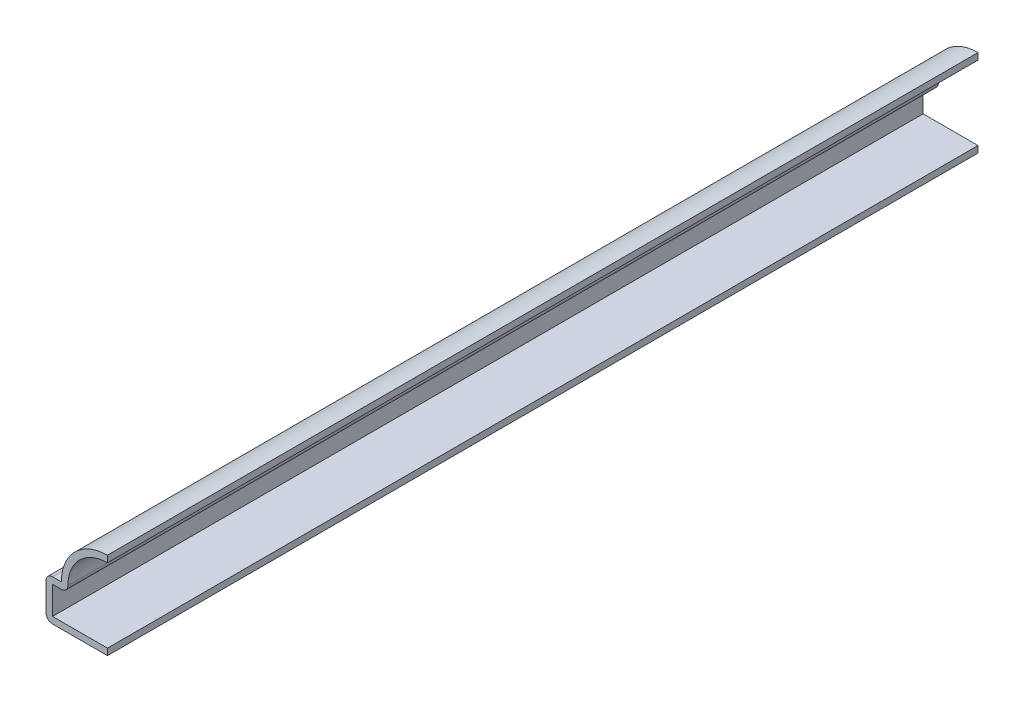
ISO-10303-21;
HEADER;
FILE_DESCRIPTION(('STEP AP214'),'2;1');
FILE_NAME('part.step','',(''),(''),'','','');
FILE_SCHEMA(('AUTOMOTIVE_DESIGN { 1 0 10303 214 1 1 1 1 }'));
ENDSEC;
DATA;
#1=APPLICATION_CONTEXT('core data for automotive mechanical design processes');
#2=APPLICATION_PROTOCOL_DEFINITION('international standard','automotive_design',2000,#1);
#3=PRODUCT_CONTEXT('',#1,'mechanical');
#4=PRODUCT('Part','Part','',(#3));
#5=PRODUCT_RELATED_PRODUCT_CATEGORY('part','',(#4));
#6=PRODUCT_DEFINITION_FORMATION('','',#4);
#7=PRODUCT_DEFINITION_CONTEXT('part definition',#1,'design');
#8=PRODUCT_DEFINITION('design','',#6,#7);
#9=PRODUCT_DEFINITION_SHAPE('','',#8);
#10=(LENGTH_UNIT() NAMED_UNIT(*) SI_UNIT(.MILLI.,.METRE.));
#11=(NAMED_UNIT(*) PLANE_ANGLE_UNIT() SI_UNIT($,.RADIAN.));
#12=(NAMED_UNIT(*) SI_UNIT($,.STERADIAN.) SOLID_ANGLE_UNIT());
#13=UNCERTAINTY_MEASURE_WITH_UNIT(LENGTH_MEASURE(1.E-05),#10,'distance_accuracy_value','');
#14=(GEOMETRIC_REPRESENTATION_CONTEXT(3) GLOBAL_UNCERTAINTY_ASSIGNED_CONTEXT((#13)) GLOBAL_UNIT_ASSIGNED_CONTEXT((#10,
#11,#12)) REPRESENTATION_CONTEXT('',''));
#15=CARTESIAN_POINT('',(0.,0.,0.));
#16=DIRECTION('',(0.,0.,1.));
#17=DIRECTION('',(1.,0.,0.));
#18=AXIS2_PLACEMENT_3D('',#15,#16,#17);
#19=CARTESIAN_POINT('',(0.,6.35,-134.9375));
#20=DIRECTION('',(0.,0.,1.));
#21=DIRECTION('',(1.,0.,0.));
#22=AXIS2_PLACEMENT_3D('',#19,#20,#21);
#23=CYLINDRICAL_SURFACE('',#22,6.12775);
#24=CARTESIAN_POINT('',(0.,6.35,0.));
#25=DIRECTION('',(0.,0.,1.));
#26=DIRECTION('',(1.,0.,0.));
#27=AXIS2_PLACEMENT_3D('',#24,#25,#26);
#28=CIRCLE('',#27,6.12775);
#29=CARTESIAN_POINT('',(-6.12775,6.35,0.));
#30=VERTEX_POINT('',#29);
#31=CARTESIAN_POINT('',(0.,12.47775,0.));
#32=VERTEX_POINT('',#31);
#33=EDGE_CURVE('E219',#30,#32,#28,.F.);
#34=ORIENTED_EDGE('',*,*,#33,.F.);
#35=DIRECTION('',(0.,0.,1.));
#36=VECTOR('',#35,1.);
#37=CARTESIAN_POINT('',(-6.12775,6.35,-134.9375));
#38=LINE('',#37,#36);
#39=CARTESIAN_POINT('',(-6.12775,6.35,-134.9375));
#40=VERTEX_POINT('',#39);
#41=EDGE_CURVE('E11',#30,#40,#38,.F.);
#42=ORIENTED_EDGE('',*,*,#41,.T.);
#43=CARTESIAN_POINT('',(0.,6.35,-134.9375));
#44=DIRECTION('',(0.,0.,1.));
#45=DIRECTION('',(1.,0.,0.));
#46=AXIS2_PLACEMENT_3D('',#43,#44,#45);
#47=CIRCLE('',#46,6.12775);
#48=CARTESIAN_POINT('',(0.,12.47775,-134.9375));
#49=VERTEX_POINT('',#48);
#50=EDGE_CURVE('E130',#40,#49,#47,.F.);
#51=ORIENTED_EDGE('',*,*,#50,.T.);
#52=DIRECTION('',(0.,0.,1.));
#53=VECTOR('',#52,1.);
#54=CARTESIAN_POINT('',(0.,12.47775,-134.9375));
#55=LINE('',#54,#53);
#56=EDGE_CURVE('E134',#49,#32,#55,.T.);
#57=ORIENTED_EDGE('',*,*,#56,.T.);
#58=EDGE_LOOP('',(#34,#42,#51,#57));
#59=FACE_BOUND('',#58,.T.);
#60=ADVANCED_FACE('F35',(#59),#23,.F.);
#61=CARTESIAN_POINT('',(-9.525,5.334,-134.9375));
#62=DIRECTION('',(0.,-1.,0.));
#63=DIRECTION('',(1.,0.,0.));
#64=AXIS2_PLACEMENT_3D('',#61,#62,#63);
#65=PLANE('',#64);
#66=DIRECTION('',(1.,0.,0.));
#67=VECTOR('',#66,1.);
#68=CARTESIAN_POINT('',(-9.525,5.334,-134.9375));
#69=LINE('',#68,#67);
#70=CARTESIAN_POINT('',(-8.509,5.334,-134.9375));
#71=VERTEX_POINT('',#70);
#72=CARTESIAN_POINT('',(-7.14375,5.334,-134.9375));
#73=VERTEX_POINT('',#72);
#74=EDGE_CURVE('E153',#71,#73,#69,.T.);
#75=ORIENTED_EDGE('',*,*,#74,.T.);
#76=DIRECTION('',(0.,0.,1.));
#77=VECTOR('',#76,1.);
#78=CARTESIAN_POINT('',(-7.14375,5.334,-134.9375));
#79=LINE('',#78,#77);
#80=CARTESIAN_POINT('',(-7.14375,5.334,0.));
#81=VERTEX_POINT('',#80);
#82=EDGE_CURVE('E43',#73,#81,#79,.T.);
#83=ORIENTED_EDGE('',*,*,#82,.T.);
#84=DIRECTION('',(1.,0.,0.));
#85=VECTOR('',#84,1.);
#86=CARTESIAN_POINT('',(-9.525,5.334,0.));
#87=LINE('',#86,#85);
#88=CARTESIAN_POINT('',(-8.509,5.334,0.));
#89=VERTEX_POINT('',#88);
#90=EDGE_CURVE('E138',#89,#81,#87,.T.);
#91=ORIENTED_EDGE('',*,*,#90,.F.);
#92=DIRECTION('',(0.,0.,1.));
#93=VECTOR('',#92,1.);
#94=CARTESIAN_POINT('',(-8.509,5.334,-134.9375));
#95=LINE('',#94,#93);
#96=EDGE_CURVE('E164',#71,#89,#95,.T.);
#97=ORIENTED_EDGE('',*,*,#96,.F.);
#98=EDGE_LOOP('',(#75,#83,#91,#97));
#99=FACE_BOUND('',#98,.T.);
#100=ADVANCED_FACE('F186',(#99),#65,.T.);
#101=CARTESIAN_POINT('',(-8.509,0.,-134.9375));
#102=DIRECTION('',(1.,0.,0.));
#103=DIRECTION('',(0.,0.,-1.));
#104=AXIS2_PLACEMENT_3D('',#101,#102,#103);
#105=PLANE('',#104);
#106=DIRECTION('',(0.,1.,0.));
#107=VECTOR('',#106,1.);
#108=CARTESIAN_POINT('',(-8.509,0.,0.));
#109=LINE('',#108,#107);
#110=CARTESIAN_POINT('',(-8.509,1.016,0.));
#111=VERTEX_POINT('',#110);
#112=EDGE_CURVE('E194',#111,#89,#109,.T.);
#113=ORIENTED_EDGE('',*,*,#112,.F.);
#114=DIRECTION('',(0.,0.,1.));
#115=VECTOR('',#114,1.);
#116=CARTESIAN_POINT('',(-8.509,1.016,-134.9375));
#117=LINE('',#116,#115);
#118=CARTESIAN_POINT('',(-8.509,1.016,-134.9375));
#119=VERTEX_POINT('',#118);
#120=EDGE_CURVE('E201',#119,#111,#117,.T.);
#121=ORIENTED_EDGE('',*,*,#120,.F.);
#122=DIRECTION('',(0.,1.,0.));
#123=VECTOR('',#122,1.);
#124=CARTESIAN_POINT('',(-8.509,0.,-134.9375));
#125=LINE('',#124,#123);
#126=EDGE_CURVE('E157',#119,#71,#125,.T.);
#127=ORIENTED_EDGE('',*,*,#126,.T.);
#128=ORIENTED_EDGE('',*,*,#96,.T.);
#129=EDGE_LOOP('',(#113,#121,#127,#128));
#130=FACE_BOUND('',#129,.T.);
#131=ADVANCED_FACE('F241',(#130),#105,.T.);
#132=CARTESIAN_POINT('',(0.,1.016,-134.9375));
#133=DIRECTION('',(0.,1.,0.));
#134=DIRECTION('',(0.,0.,1.));
#135=AXIS2_PLACEMENT_3D('',#132,#133,#134);
#136=PLANE('',#135);
#137=DIRECTION('',(1.,0.,0.));
#138=VECTOR('',#137,1.);
#139=CARTESIAN_POINT('',(0.,1.016,0.));
#140=LINE('',#139,#138);
#141=CARTESIAN_POINT('',(0.,1.016,0.));
#142=VERTEX_POINT('',#141);
#143=EDGE_CURVE('E196',#142,#111,#140,.F.);
#144=ORIENTED_EDGE('',*,*,#143,.F.);
#145=DIRECTION('',(0.,0.,1.));
#146=VECTOR('',#145,1.);
#147=CARTESIAN_POINT('',(0.,1.016,-134.9375));
#148=LINE('',#147,#146);
#149=CARTESIAN_POINT('',(0.,1.016,-134.9375));
#150=VERTEX_POINT('',#149);
#151=EDGE_CURVE('E203',#150,#142,#148,.T.);
#152=ORIENTED_EDGE('',*,*,#151,.F.);
#153=DIRECTION('',(1.,0.,0.));
#154=VECTOR('',#153,1.);
#155=CARTESIAN_POINT('',(0.,1.016,-134.9375));
#156=LINE('',#155,#154);
#157=EDGE_CURVE('E237',#150,#119,#156,.F.);
#158=ORIENTED_EDGE('',*,*,#157,.T.);
#159=ORIENTED_EDGE('',*,*,#120,.T.);
#160=EDGE_LOOP('',(#144,#152,#158,#159));
#161=FACE_BOUND('',#160,.T.);
#162=ADVANCED_FACE('F233',(#161),#136,.T.);
#163=CARTESIAN_POINT('',(0.,1.016,-134.9375));
#164=DIRECTION('',(-1.,0.,0.));
#165=DIRECTION('',(0.,0.,1.));
#166=AXIS2_PLACEMENT_3D('',#163,#164,#165);
#167=PLANE('',#166);
#168=DIRECTION('',(0.,-1.,0.));
#169=VECTOR('',#168,1.);
#170=CARTESIAN_POINT('',(0.,1.016,0.));
#171=LINE('',#170,#169);
#172=CARTESIAN_POINT('',(0.,0.,0.));
#173=VERTEX_POINT('',#172);
#174=EDGE_CURVE('E228',#142,#173,#171,.T.);
#175=ORIENTED_EDGE('',*,*,#174,.T.);
#176=DIRECTION('',(0.,0.,1.));
#177=VECTOR('',#176,1.);
#178=CARTESIAN_POINT('',(0.,0.,-134.9375));
#179=LINE('',#178,#177);
#180=CARTESIAN_POINT('',(0.,0.,-134.9375));
#181=VERTEX_POINT('',#180);
#182=EDGE_CURVE('E205',#181,#173,#179,.T.);
#183=ORIENTED_EDGE('',*,*,#182,.F.);
#184=DIRECTION('',(0.,-1.,0.));
#185=VECTOR('',#184,1.);
#186=CARTESIAN_POINT('',(0.,1.016,-134.9375));
#187=LINE('',#186,#185);
#188=EDGE_CURVE('E243',#150,#181,#187,.T.);
#189=ORIENTED_EDGE('',*,*,#188,.F.);
#190=ORIENTED_EDGE('',*,*,#151,.T.);
#191=EDGE_LOOP('',(#175,#183,#189,#190));
#192=FACE_BOUND('',#191,.T.);
#193=ADVANCED_FACE('F285',(#192),#167,.F.);
#194=CARTESIAN_POINT('',(0.,0.,-134.9375));
#195=DIRECTION('',(0.,1.,0.));
#196=DIRECTION('',(0.,0.,1.));
#197=AXIS2_PLACEMENT_3D('',#194,#195,#196);
#198=PLANE('',#197);
#199=DIRECTION('',(-1.,0.,0.));
#200=VECTOR('',#199,1.);
#201=CARTESIAN_POINT('',(0.,0.,0.));
#202=LINE('',#201,#200);
#203=CARTESIAN_POINT('',(-8.509,0.,0.));
#204=VERTEX_POINT('',#203);
#205=EDGE_CURVE('E225',#173,#204,#202,.T.);
#206=ORIENTED_EDGE('',*,*,#205,.T.);
#207=DIRECTION('',(0.,0.,1.));
#208=VECTOR('',#207,1.);
#209=CARTESIAN_POINT('',(-8.509,0.,-134.9375));
#210=LINE('',#209,#208);
#211=CARTESIAN_POINT('',(-8.509,0.,-134.9375));
#212=VERTEX_POINT('',#211);
#213=EDGE_CURVE('E173',#204,#212,#210,.F.);
#214=ORIENTED_EDGE('',*,*,#213,.T.);
#215=DIRECTION('',(-1.,0.,0.));
#216=VECTOR('',#215,1.);
#217=CARTESIAN_POINT('',(0.,0.,-134.9375));
#218=LINE('',#217,#216);
#219=EDGE_CURVE('E274',#181,#212,#218,.T.);
#220=ORIENTED_EDGE('',*,*,#219,.F.);
#221=ORIENTED_EDGE('',*,*,#182,.T.);
#222=EDGE_LOOP('',(#206,#214,#220,#221));
#223=FACE_BOUND('',#222,.T.);
#224=ADVANCED_FACE('F287',(#223),#198,.F.);
#225=CARTESIAN_POINT('',(-9.525,0.,-134.9375));
#226=DIRECTION('',(1.,0.,0.));
#227=DIRECTION('',(0.,0.,-1.));
#228=AXIS2_PLACEMENT_3D('',#225,#226,#227);
#229=PLANE('',#228);
#230=DIRECTION('',(0.,1.,0.));
#231=VECTOR('',#230,1.);
#232=CARTESIAN_POINT('',(-9.525,0.,-134.9375));
#233=LINE('',#232,#231);
#234=CARTESIAN_POINT('',(-9.525,1.016,-134.9375));
#235=VERTEX_POINT('',#234);
#236=CARTESIAN_POINT('',(-9.525,5.334,-134.9375));
#237=VERTEX_POINT('',#236);
#238=EDGE_CURVE('E272',#235,#237,#233,.T.);
#239=ORIENTED_EDGE('',*,*,#238,.F.);
#240=DIRECTION('',(0.,0.,1.));
#241=VECTOR('',#240,1.);
#242=CARTESIAN_POINT('',(-9.525,1.016,-134.9375));
#243=LINE('',#242,#241);
#244=CARTESIAN_POINT('',(-9.525,1.016,0.));
#245=VERTEX_POINT('',#244);
#246=EDGE_CURVE('E163',#235,#245,#243,.T.);
#247=ORIENTED_EDGE('',*,*,#246,.T.);
#248=DIRECTION('',(0.,1.,0.));
#249=VECTOR('',#248,1.);
#250=CARTESIAN_POINT('',(-9.525,0.,0.));
#251=LINE('',#250,#249);
#252=CARTESIAN_POINT('',(-9.525,5.334,0.));
#253=VERTEX_POINT('',#252);
#254=EDGE_CURVE('E217',#245,#253,#251,.T.);
#255=ORIENTED_EDGE('',*,*,#254,.T.);
#256=DIRECTION('',(0.,0.,1.));
#257=VECTOR('',#256,1.);
#258=CARTESIAN_POINT('',(-9.525,5.334,-134.9375));
#259=LINE('',#258,#257);
#260=EDGE_CURVE('E161',#253,#237,#259,.F.);
#261=ORIENTED_EDGE('',*,*,#260,.T.);
#262=EDGE_LOOP('',(#239,#247,#255,#261));
#263=FACE_BOUND('',#262,.T.);
#264=ADVANCED_FACE('F276',(#263),#229,.F.);
#265=CARTESIAN_POINT('',(-9.525,6.35,-134.9375));
#266=DIRECTION('',(0.,-1.,0.));
#267=DIRECTION('',(1.,0.,0.));
#268=AXIS2_PLACEMENT_3D('',#265,#266,#267);
#269=PLANE('',#268);
#270=DIRECTION('',(1.,0.,0.));
#271=VECTOR('',#270,1.);
#272=CARTESIAN_POINT('',(-9.525,6.35,-134.9375));
#273=LINE('',#272,#271);
#274=CARTESIAN_POINT('',(-8.509,6.35,-134.9375));
#275=VERTEX_POINT('',#274);
#276=CARTESIAN_POINT('',(-7.14375,6.35,-134.9375));
#277=VERTEX_POINT('',#276);
#278=EDGE_CURVE('E278',#275,#277,#273,.T.);
#279=ORIENTED_EDGE('',*,*,#278,.F.);
#280=DIRECTION('',(0.,0.,1.));
#281=VECTOR('',#280,1.);
#282=CARTESIAN_POINT('',(-8.509,6.35,-134.9375));
#283=LINE('',#282,#281);
#284=CARTESIAN_POINT('',(-8.509,6.35,0.));
#285=VERTEX_POINT('',#284);
#286=EDGE_CURVE('E179',#275,#285,#283,.T.);
#287=ORIENTED_EDGE('',*,*,#286,.T.);
#288=DIRECTION('',(1.,0.,0.));
#289=VECTOR('',#288,1.);
#290=CARTESIAN_POINT('',(-9.525,6.35,0.));
#291=LINE('',#290,#289);
#292=CARTESIAN_POINT('',(-7.14375,6.35,0.));
#293=VERTEX_POINT('',#292);
#294=EDGE_CURVE('E215',#285,#293,#291,.T.);
#295=ORIENTED_EDGE('',*,*,#294,.T.);
#296=DIRECTION('',(0.,0.,1.));
#297=VECTOR('',#296,1.);
#298=CARTESIAN_POINT('',(-7.14375,6.35,-134.9375));
#299=LINE('',#298,#297);
#300=EDGE_CURVE('E155',#277,#293,#299,.T.);
#301=ORIENTED_EDGE('',*,*,#300,.F.);
#302=EDGE_LOOP('',(#279,#287,#295,#301));
#303=FACE_BOUND('',#302,.T.);
#304=ADVANCED_FACE('F289',(#303),#269,.F.);
#305=CARTESIAN_POINT('',(0.,6.35,-134.9375));
#306=DIRECTION('',(0.,0.,1.));
#307=DIRECTION('',(1.,0.,0.));
#308=AXIS2_PLACEMENT_3D('',#305,#306,#307);
#309=CYLINDRICAL_SURFACE('',#308,7.14375);
#310=CARTESIAN_POINT('',(0.,6.35,0.));
#311=DIRECTION('',(0.,0.,-1.));
#312=DIRECTION('',(-1.,0.,0.));
#313=AXIS2_PLACEMENT_3D('',#310,#311,#312);
#314=CIRCLE('',#313,7.14375);
#315=CARTESIAN_POINT('',(0.,13.49375,0.));
#316=VERTEX_POINT('',#315);
#317=EDGE_CURVE('E212',#293,#316,#314,.T.);
#318=ORIENTED_EDGE('',*,*,#317,.T.);
#319=DIRECTION('',(0.,0.,1.));
#320=VECTOR('',#319,1.);
#321=CARTESIAN_POINT('',(0.,13.49375,-134.9375));
#322=LINE('',#321,#320);
#323=CARTESIAN_POINT('',(0.,13.49375,-134.9375));
#324=VERTEX_POINT('',#323);
#325=EDGE_CURVE('E152',#324,#316,#322,.T.);
#326=ORIENTED_EDGE('',*,*,#325,.F.);
#327=CARTESIAN_POINT('',(0.,6.35,-134.9375));
#328=DIRECTION('',(0.,0.,-1.));
#329=DIRECTION('',(-1.,0.,0.));
#330=AXIS2_PLACEMENT_3D('',#327,#328,#329);
#331=CIRCLE('',#330,7.14375);
#332=EDGE_CURVE('E144',#277,#324,#331,.T.);
#333=ORIENTED_EDGE('',*,*,#332,.F.);
#334=ORIENTED_EDGE('',*,*,#300,.T.);
#335=EDGE_LOOP('',(#318,#326,#333,#334));
#336=FACE_BOUND('',#335,.T.);
#337=ADVANCED_FACE('F211',(#336),#309,.T.);
#338=CARTESIAN_POINT('',(0.,13.49375,-134.9375));
#339=DIRECTION('',(-1.,0.,0.));
#340=DIRECTION('',(0.,-1.,0.));
#341=AXIS2_PLACEMENT_3D('',#338,#339,#340);
#342=PLANE('',#341);
#343=DIRECTION('',(0.,-1.,0.));
#344=VECTOR('',#343,1.);
#345=CARTESIAN_POINT('',(0.,13.49375,0.));
#346=LINE('',#345,#344);
#347=EDGE_CURVE('E151',#316,#32,#346,.T.);
#348=ORIENTED_EDGE('',*,*,#347,.T.);
#349=ORIENTED_EDGE('',*,*,#56,.F.);
#350=DIRECTION('',(0.,-1.,0.));
#351=VECTOR('',#350,1.);
#352=CARTESIAN_POINT('',(0.,13.49375,-134.9375));
#353=LINE('',#352,#351);
#354=EDGE_CURVE('E137',#324,#49,#353,.T.);
#355=ORIENTED_EDGE('',*,*,#354,.F.);
#356=ORIENTED_EDGE('',*,*,#325,.T.);
#357=EDGE_LOOP('',(#348,#349,#355,#356));
#358=FACE_BOUND('',#357,.T.);
#359=ADVANCED_FACE('F149',(#358),#342,.F.);
#360=CARTESIAN_POINT('',(0.,6.35,-134.9375));
#361=DIRECTION('',(0.,0.,1.));
#362=DIRECTION('',(1.,0.,0.));
#363=AXIS2_PLACEMENT_3D('',#360,#361,#362);
#364=PLANE('',#363);
#365=ORIENTED_EDGE('',*,*,#219,.T.);
#366=CARTESIAN_POINT('',(-8.509,1.016,-134.9375));
#367=DIRECTION('',(0.,0.,1.));
#368=DIRECTION('',(1.,0.,0.));
#369=AXIS2_PLACEMENT_3D('',#366,#367,#368);
#370=CIRCLE('',#369,1.016);
#371=EDGE_CURVE('E177',#212,#235,#370,.F.);
#372=ORIENTED_EDGE('',*,*,#371,.T.);
#373=ORIENTED_EDGE('',*,*,#238,.T.);
#374=CARTESIAN_POINT('',(-8.509,5.334,-134.9375));
#375=DIRECTION('',(0.,0.,1.));
#376=DIRECTION('',(1.,0.,0.));
#377=AXIS2_PLACEMENT_3D('',#374,#375,#376);
#378=CIRCLE('',#377,1.016);
#379=EDGE_CURVE('E50',#237,#275,#378,.F.);
#380=ORIENTED_EDGE('',*,*,#379,.T.);
#381=ORIENTED_EDGE('',*,*,#278,.T.);
#382=ORIENTED_EDGE('',*,*,#332,.T.);
#383=ORIENTED_EDGE('',*,*,#354,.T.);
#384=ORIENTED_EDGE('',*,*,#50,.F.);
#385=CARTESIAN_POINT('',(-7.14375,6.35,-134.9375));
#386=DIRECTION('',(0.,0.,1.));
#387=DIRECTION('',(1.,0.,0.));
#388=AXIS2_PLACEMENT_3D('',#385,#386,#387);
#389=CIRCLE('',#388,1.016);
#390=EDGE_CURVE('E57',#40,#73,#389,.F.);
#391=ORIENTED_EDGE('',*,*,#390,.T.);
#392=ORIENTED_EDGE('',*,*,#74,.F.);
#393=ORIENTED_EDGE('',*,*,#126,.F.);
#394=ORIENTED_EDGE('',*,*,#157,.F.);
#395=ORIENTED_EDGE('',*,*,#188,.T.);
#396=EDGE_LOOP('',(#365,#372,#373,#380,#381,#382,#383,#384,#391,#392,#393,#394,#395));
#397=FACE_BOUND('',#396,.T.);
#398=ADVANCED_FACE('F142',(#397),#364,.F.);
#399=CARTESIAN_POINT('',(0.,6.35,0.));
#400=DIRECTION('',(0.,0.,1.));
#401=DIRECTION('',(1.,0.,0.));
#402=AXIS2_PLACEMENT_3D('',#399,#400,#401);
#403=PLANE('',#402);
#404=ORIENTED_EDGE('',*,*,#254,.F.);
#405=CARTESIAN_POINT('',(-8.509,1.016,0.));
#406=DIRECTION('',(0.,0.,1.));
#407=DIRECTION('',(1.,0.,0.));
#408=AXIS2_PLACEMENT_3D('',#405,#406,#407);
#409=CIRCLE('',#408,1.016);
#410=EDGE_CURVE('E171',#245,#204,#409,.T.);
#411=ORIENTED_EDGE('',*,*,#410,.T.);
#412=ORIENTED_EDGE('',*,*,#205,.F.);
#413=ORIENTED_EDGE('',*,*,#174,.F.);
#414=ORIENTED_EDGE('',*,*,#143,.T.);
#415=ORIENTED_EDGE('',*,*,#112,.T.);
#416=ORIENTED_EDGE('',*,*,#90,.T.);
#417=CARTESIAN_POINT('',(-7.14375,6.35,0.));
#418=DIRECTION('',(0.,0.,1.));
#419=DIRECTION('',(1.,0.,0.));
#420=AXIS2_PLACEMENT_3D('',#417,#418,#419);
#421=CIRCLE('',#420,1.016);
#422=EDGE_CURVE('E167',#81,#30,#421,.T.);
#423=ORIENTED_EDGE('',*,*,#422,.T.);
#424=ORIENTED_EDGE('',*,*,#33,.T.);
#425=ORIENTED_EDGE('',*,*,#347,.F.);
#426=ORIENTED_EDGE('',*,*,#317,.F.);
#427=ORIENTED_EDGE('',*,*,#294,.F.);
#428=CARTESIAN_POINT('',(-8.509,5.334,0.));
#429=DIRECTION('',(0.,0.,1.));
#430=DIRECTION('',(1.,0.,0.));
#431=AXIS2_PLACEMENT_3D('',#428,#429,#430);
#432=CIRCLE('',#431,1.016);
#433=EDGE_CURVE('E169',#285,#253,#432,.T.);
#434=ORIENTED_EDGE('',*,*,#433,.T.);
#435=EDGE_LOOP('',(#404,#411,#412,#413,#414,#415,#416,#423,#424,#425,#426,#427,#434));
#436=FACE_BOUND('',#435,.T.);
#437=ADVANCED_FACE('F191',(#436),#403,.T.);
#438=CARTESIAN_POINT('',(-8.509,1.016,-134.9375));
#439=DIRECTION('',(0.,0.,1.));
#440=DIRECTION('',(1.,0.,0.));
#441=AXIS2_PLACEMENT_3D('',#438,#439,#440);
#442=CYLINDRICAL_SURFACE('',#441,1.016);
#443=ORIENTED_EDGE('',*,*,#371,.F.);
#444=ORIENTED_EDGE('',*,*,#213,.F.);
#445=ORIENTED_EDGE('',*,*,#410,.F.);
#446=ORIENTED_EDGE('',*,*,#246,.F.);
#447=EDGE_LOOP('',(#443,#444,#445,#446));
#448=FACE_BOUND('',#447,.T.);
#449=ADVANCED_FACE('F251',(#448),#442,.T.);
#450=CARTESIAN_POINT('',(-8.509,5.334,-134.9375));
#451=DIRECTION('',(0.,0.,1.));
#452=DIRECTION('',(1.,0.,0.));
#453=AXIS2_PLACEMENT_3D('',#450,#451,#452);
#454=CYLINDRICAL_SURFACE('',#453,1.016);
#455=ORIENTED_EDGE('',*,*,#379,.F.);
#456=ORIENTED_EDGE('',*,*,#260,.F.);
#457=ORIENTED_EDGE('',*,*,#433,.F.);
#458=ORIENTED_EDGE('',*,*,#286,.F.);
#459=EDGE_LOOP('',(#455,#456,#457,#458));
#460=FACE_BOUND('',#459,.T.);
#461=ADVANCED_FACE('F247',(#460),#454,.T.);
#462=CARTESIAN_POINT('',(-7.14375,6.35,-134.9375));
#463=DIRECTION('',(0.,0.,1.));
#464=DIRECTION('',(1.,0.,0.));
#465=AXIS2_PLACEMENT_3D('',#462,#463,#464);
#466=CYLINDRICAL_SURFACE('',#465,1.016);
#467=ORIENTED_EDGE('',*,*,#390,.F.);
#468=ORIENTED_EDGE('',*,*,#41,.F.);
#469=ORIENTED_EDGE('',*,*,#422,.F.);
#470=ORIENTED_EDGE('',*,*,#82,.F.);
#471=EDGE_LOOP('',(#467,#468,#469,#470));
#472=FACE_BOUND('',#471,.T.);
#473=ADVANCED_FACE('F37',(#472),#466,.T.);
#474=CLOSED_SHELL('',(#60,#100,#131,#162,#193,#224,#264,#304,#337,#359,#398,#437,#449,#461,#473));
#475=MANIFOLD_SOLID_BREP('B2',#474);
#476=ADVANCED_BREP_SHAPE_REPRESENTATION('',(#18,#475),#14);
#477=SHAPE_DEFINITION_REPRESENTATION(#9,#476);
ENDSEC;
END-ISO-10303-21;
